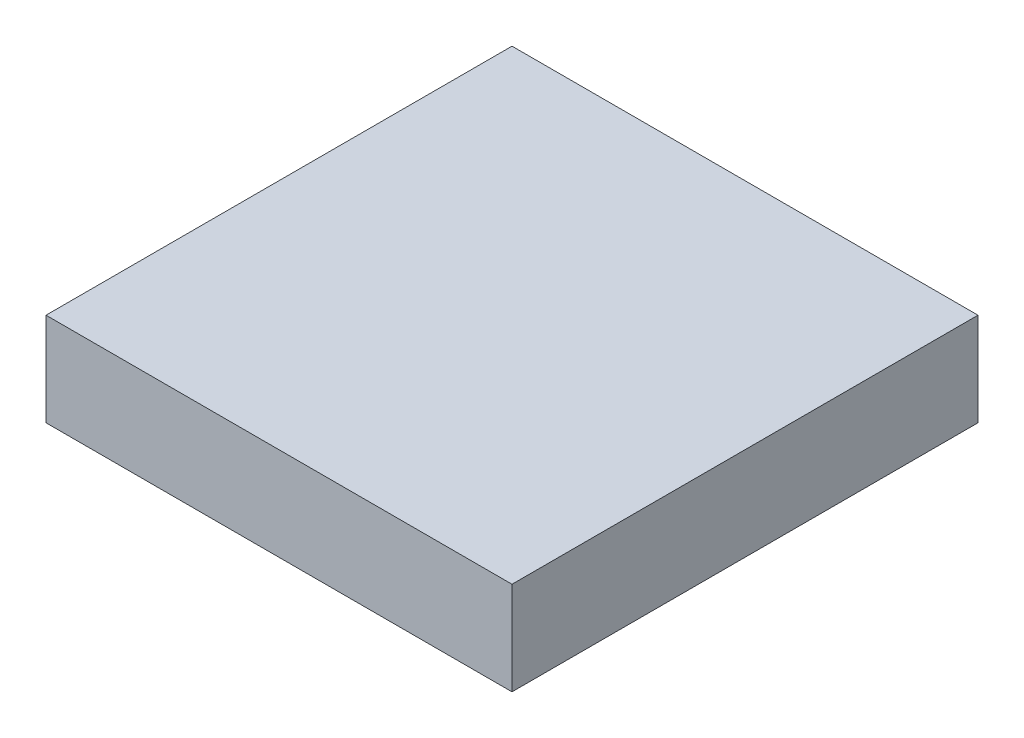
ISO-10303-21;
HEADER;
FILE_DESCRIPTION(('STEP AP214'),'2;1');
FILE_NAME('part.step','',(''),(''),'','','');
FILE_SCHEMA(('AUTOMOTIVE_DESIGN { 1 0 10303 214 1 1 1 1 }'));
ENDSEC;
DATA;
#1=APPLICATION_CONTEXT('core data for automotive mechanical design processes');
#2=APPLICATION_PROTOCOL_DEFINITION('international standard','automotive_design',2000,#1);
#3=PRODUCT_CONTEXT('',#1,'mechanical');
#4=PRODUCT('Part','Part','',(#3));
#5=PRODUCT_RELATED_PRODUCT_CATEGORY('part','',(#4));
#6=PRODUCT_DEFINITION_FORMATION('','',#4);
#7=PRODUCT_DEFINITION_CONTEXT('part definition',#1,'design');
#8=PRODUCT_DEFINITION('design','',#6,#7);
#9=PRODUCT_DEFINITION_SHAPE('','',#8);
#10=(LENGTH_UNIT() NAMED_UNIT(*) SI_UNIT(.MILLI.,.METRE.));
#11=(NAMED_UNIT(*) PLANE_ANGLE_UNIT() SI_UNIT($,.RADIAN.));
#12=(NAMED_UNIT(*) SI_UNIT($,.STERADIAN.) SOLID_ANGLE_UNIT());
#13=UNCERTAINTY_MEASURE_WITH_UNIT(LENGTH_MEASURE(1.E-05),#10,'distance_accuracy_value','');
#14=(GEOMETRIC_REPRESENTATION_CONTEXT(3) GLOBAL_UNCERTAINTY_ASSIGNED_CONTEXT((#13)) GLOBAL_UNIT_ASSIGNED_CONTEXT((#10,
#11,#12)) REPRESENTATION_CONTEXT('',''));
#15=CARTESIAN_POINT('',(0.,0.,0.));
#16=DIRECTION('',(0.,0.,1.));
#17=DIRECTION('',(1.,0.,0.));
#18=AXIS2_PLACEMENT_3D('',#15,#16,#17);
#19=CARTESIAN_POINT('',(1.75,0.7,1.75));
#20=DIRECTION('',(-1.,0.,0.));
#21=DIRECTION('',(0.,0.,1.));
#22=AXIS2_PLACEMENT_3D('',#19,#20,#21);
#23=PLANE('',#22);
#24=DIRECTION('',(0.,0.,-1.));
#25=VECTOR('',#24,1.);
#26=CARTESIAN_POINT('',(1.75,0.,1.75));
#27=LINE('',#26,#25);
#28=CARTESIAN_POINT('',(1.75,0.,1.75));
#29=VERTEX_POINT('',#28);
#30=CARTESIAN_POINT('',(1.75,0.,-1.75));
#31=VERTEX_POINT('',#30);
#32=EDGE_CURVE('E97',#29,#31,#27,.T.);
#33=ORIENTED_EDGE('',*,*,#32,.T.);
#34=DIRECTION('',(0.,-1.,0.));
#35=VECTOR('',#34,1.);
#36=CARTESIAN_POINT('',(1.75,0.7,-1.75));
#37=LINE('',#36,#35);
#38=CARTESIAN_POINT('',(1.75,0.7,-1.75));
#39=VERTEX_POINT('',#38);
#40=EDGE_CURVE('E11',#39,#31,#37,.T.);
#41=ORIENTED_EDGE('',*,*,#40,.F.);
#42=DIRECTION('',(0.,0.,-1.));
#43=VECTOR('',#42,1.);
#44=CARTESIAN_POINT('',(1.75,0.7,1.75));
#45=LINE('',#44,#43);
#46=CARTESIAN_POINT('',(1.75,0.7,1.75));
#47=VERTEX_POINT('',#46);
#48=EDGE_CURVE('E85',#47,#39,#45,.T.);
#49=ORIENTED_EDGE('',*,*,#48,.F.);
#50=DIRECTION('',(0.,-1.,0.));
#51=VECTOR('',#50,1.);
#52=CARTESIAN_POINT('',(1.75,0.7,1.75));
#53=LINE('',#52,#51);
#54=EDGE_CURVE('E93',#47,#29,#53,.T.);
#55=ORIENTED_EDGE('',*,*,#54,.T.);
#56=EDGE_LOOP('',(#33,#41,#49,#55));
#57=FACE_BOUND('',#56,.T.);
#58=ADVANCED_FACE('F34',(#57),#23,.F.);
#59=CARTESIAN_POINT('',(-1.75,0.7,-1.75));
#60=DIRECTION('',(0.,0.,1.));
#61=DIRECTION('',(1.,0.,0.));
#62=AXIS2_PLACEMENT_3D('',#59,#60,#61);
#63=PLANE('',#62);
#64=DIRECTION('',(-1.,0.,0.));
#65=VECTOR('',#64,1.);
#66=CARTESIAN_POINT('',(-1.75,0.,-1.75));
#67=LINE('',#66,#65);
#68=CARTESIAN_POINT('',(-1.75,0.,-1.75));
#69=VERTEX_POINT('',#68);
#70=EDGE_CURVE('E89',#31,#69,#67,.T.);
#71=ORIENTED_EDGE('',*,*,#70,.T.);
#72=DIRECTION('',(0.,-1.,0.));
#73=VECTOR('',#72,1.);
#74=CARTESIAN_POINT('',(-1.75,0.7,-1.75));
#75=LINE('',#74,#73);
#76=CARTESIAN_POINT('',(-1.75,0.7,-1.75));
#77=VERTEX_POINT('',#76);
#78=EDGE_CURVE('E42',#77,#69,#75,.T.);
#79=ORIENTED_EDGE('',*,*,#78,.F.);
#80=DIRECTION('',(-1.,0.,0.));
#81=VECTOR('',#80,1.);
#82=CARTESIAN_POINT('',(-1.75,0.7,-1.75));
#83=LINE('',#82,#81);
#84=EDGE_CURVE('E80',#39,#77,#83,.T.);
#85=ORIENTED_EDGE('',*,*,#84,.F.);
#86=ORIENTED_EDGE('',*,*,#40,.T.);
#87=EDGE_LOOP('',(#71,#79,#85,#86));
#88=FACE_BOUND('',#87,.T.);
#89=ADVANCED_FACE('F88',(#88),#63,.F.);
#90=CARTESIAN_POINT('',(-1.75,0.7,1.75));
#91=DIRECTION('',(1.,0.,0.));
#92=DIRECTION('',(0.,0.,-1.));
#93=AXIS2_PLACEMENT_3D('',#90,#91,#92);
#94=PLANE('',#93);
#95=DIRECTION('',(0.,0.,1.));
#96=VECTOR('',#95,1.);
#97=CARTESIAN_POINT('',(-1.75,0.,1.75));
#98=LINE('',#97,#96);
#99=CARTESIAN_POINT('',(-1.75,0.,1.75));
#100=VERTEX_POINT('',#99);
#101=EDGE_CURVE('E67',#69,#100,#98,.T.);
#102=ORIENTED_EDGE('',*,*,#101,.T.);
#103=DIRECTION('',(0.,-1.,0.));
#104=VECTOR('',#103,1.);
#105=CARTESIAN_POINT('',(-1.75,0.7,1.75));
#106=LINE('',#105,#104);
#107=CARTESIAN_POINT('',(-1.75,0.7,1.75));
#108=VERTEX_POINT('',#107);
#109=EDGE_CURVE('E90',#108,#100,#106,.T.);
#110=ORIENTED_EDGE('',*,*,#109,.F.);
#111=DIRECTION('',(0.,0.,1.));
#112=VECTOR('',#111,1.);
#113=CARTESIAN_POINT('',(-1.75,0.7,1.75));
#114=LINE('',#113,#112);
#115=EDGE_CURVE('E83',#77,#108,#114,.T.);
#116=ORIENTED_EDGE('',*,*,#115,.F.);
#117=ORIENTED_EDGE('',*,*,#78,.T.);
#118=EDGE_LOOP('',(#102,#110,#116,#117));
#119=FACE_BOUND('',#118,.T.);
#120=ADVANCED_FACE('F91',(#119),#94,.F.);
#121=CARTESIAN_POINT('',(-1.75,0.7,1.75));
#122=DIRECTION('',(0.,0.,-1.));
#123=DIRECTION('',(-1.,0.,0.));
#124=AXIS2_PLACEMENT_3D('',#121,#122,#123);
#125=PLANE('',#124);
#126=DIRECTION('',(1.,0.,0.));
#127=VECTOR('',#126,1.);
#128=CARTESIAN_POINT('',(-1.75,0.,1.75));
#129=LINE('',#128,#127);
#130=EDGE_CURVE('E73',#100,#29,#129,.T.);
#131=ORIENTED_EDGE('',*,*,#130,.T.);
#132=ORIENTED_EDGE('',*,*,#54,.F.);
#133=DIRECTION('',(1.,0.,0.));
#134=VECTOR('',#133,1.);
#135=CARTESIAN_POINT('',(-1.75,0.7,1.75));
#136=LINE('',#135,#134);
#137=EDGE_CURVE('E50',#108,#47,#136,.T.);
#138=ORIENTED_EDGE('',*,*,#137,.F.);
#139=ORIENTED_EDGE('',*,*,#109,.T.);
#140=EDGE_LOOP('',(#131,#132,#138,#139));
#141=FACE_BOUND('',#140,.T.);
#142=ADVANCED_FACE('F104',(#141),#125,.F.);
#143=CARTESIAN_POINT('',(0.,0.7,0.));
#144=DIRECTION('',(0.,-1.,0.));
#145=DIRECTION('',(0.,0.,-1.));
#146=AXIS2_PLACEMENT_3D('',#143,#144,#145);
#147=PLANE('',#146);
#148=ORIENTED_EDGE('',*,*,#48,.T.);
#149=ORIENTED_EDGE('',*,*,#84,.T.);
#150=ORIENTED_EDGE('',*,*,#115,.T.);
#151=ORIENTED_EDGE('',*,*,#137,.T.);
#152=EDGE_LOOP('',(#148,#149,#150,#151));
#153=FACE_BOUND('',#152,.T.);
#154=ADVANCED_FACE('F81',(#153),#147,.F.);
#155=CARTESIAN_POINT('',(0.,0.,0.));
#156=DIRECTION('',(0.,-1.,0.));
#157=DIRECTION('',(0.,0.,-1.));
#158=AXIS2_PLACEMENT_3D('',#155,#156,#157);
#159=PLANE('',#158);
#160=ORIENTED_EDGE('',*,*,#32,.F.);
#161=ORIENTED_EDGE('',*,*,#130,.F.);
#162=ORIENTED_EDGE('',*,*,#101,.F.);
#163=ORIENTED_EDGE('',*,*,#70,.F.);
#164=EDGE_LOOP('',(#160,#161,#162,#163));
#165=FACE_BOUND('',#164,.T.);
#166=ADVANCED_FACE('F107',(#165),#159,.T.);
#167=CLOSED_SHELL('',(#58,#89,#120,#142,#154,#166));
#168=MANIFOLD_SOLID_BREP('B2',#167);
#169=ADVANCED_BREP_SHAPE_REPRESENTATION('',(#18,#168),#14);
#170=SHAPE_DEFINITION_REPRESENTATION(#9,#169);
ENDSEC;
END-ISO-10303-21;
